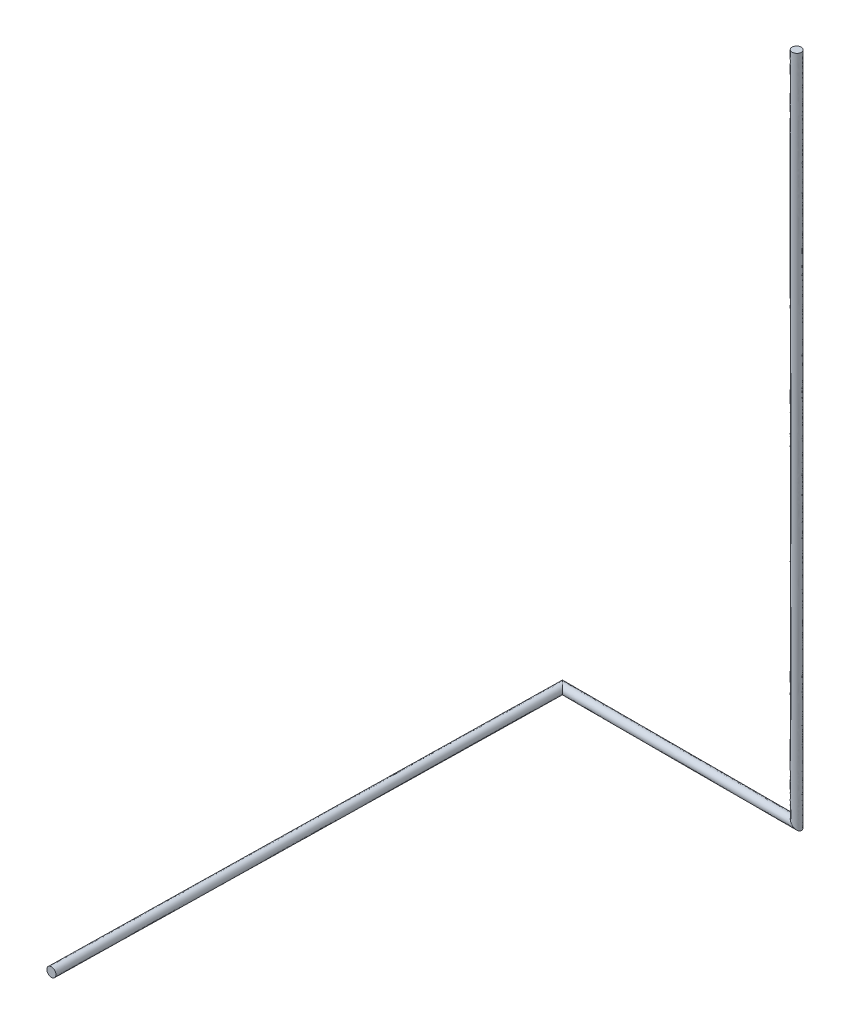
ISO-10303-21;
HEADER;
FILE_DESCRIPTION(('STEP AP214'),'2;1');
FILE_NAME('part.step','',(''),(''),'','','');
FILE_SCHEMA(('AUTOMOTIVE_DESIGN { 1 0 10303 214 1 1 1 1 }'));
ENDSEC;
DATA;
#1=APPLICATION_CONTEXT('core data for automotive mechanical design processes');
#2=APPLICATION_PROTOCOL_DEFINITION('international standard','automotive_design',2000,#1);
#3=PRODUCT_CONTEXT('',#1,'mechanical');
#4=PRODUCT('Part','Part','',(#3));
#5=PRODUCT_RELATED_PRODUCT_CATEGORY('part','',(#4));
#6=PRODUCT_DEFINITION_FORMATION('','',#4);
#7=PRODUCT_DEFINITION_CONTEXT('part definition',#1,'design');
#8=PRODUCT_DEFINITION('design','',#6,#7);
#9=PRODUCT_DEFINITION_SHAPE('','',#8);
#10=(LENGTH_UNIT() NAMED_UNIT(*) SI_UNIT(.MILLI.,.METRE.));
#11=(NAMED_UNIT(*) PLANE_ANGLE_UNIT() SI_UNIT($,.RADIAN.));
#12=(NAMED_UNIT(*) SI_UNIT($,.STERADIAN.) SOLID_ANGLE_UNIT());
#13=UNCERTAINTY_MEASURE_WITH_UNIT(LENGTH_MEASURE(1.E-05),#10,'distance_accuracy_value','');
#14=(GEOMETRIC_REPRESENTATION_CONTEXT(3) GLOBAL_UNCERTAINTY_ASSIGNED_CONTEXT((#13)) GLOBAL_UNIT_ASSIGNED_CONTEXT((#10,
#11,#12)) REPRESENTATION_CONTEXT('',''));
#15=CARTESIAN_POINT('',(0.,0.,0.));
#16=DIRECTION('',(0.,0.,1.));
#17=DIRECTION('',(1.,0.,0.));
#18=AXIS2_PLACEMENT_3D('',#15,#16,#17);
#19=CARTESIAN_POINT('',(726.915828906239,2000.,-1499.75849327626));
#20=DIRECTION('',(0.,-0.999838995517509,0.0179438859374929));
#21=DIRECTION('',(0.,0.0179438859374929,0.999838995517509));
#22=AXIS2_PLACEMENT_3D('',#19,#20,#21);
#23=PLANE('',#22);
#24=CARTESIAN_POINT('',(726.915828906239,2000.,-1499.75849327626));
#25=DIRECTION('',(0.,-0.999838995517509,0.0179438859374929));
#26=DIRECTION('',(0.,0.0179438859374929,0.999838995517509));
#27=AXIS2_PLACEMENT_3D('',#24,#25,#26);
#28=CIRCLE('',#27,13.7);
#29=CARTESIAN_POINT('',(726.915828906239,2000.24583123734,-1486.06069903767));
#30=VERTEX_POINT('',#29);
#31=EDGE_CURVE('E36',#30,#30,#28,.T.);
#32=ORIENTED_EDGE('',*,*,#31,.F.);
#33=EDGE_LOOP('',(#32));
#34=FACE_BOUND('',#33,.T.);
#35=ADVANCED_FACE('F33',(#34),#23,.F.);
#36=CARTESIAN_POINT('',(0.,0.,0.));
#37=DIRECTION('',(0.,0.,1.));
#38=DIRECTION('',(1.,0.,0.));
#39=AXIS2_PLACEMENT_3D('',#36,#37,#38);
#40=PLANE('',#39);
#41=CARTESIAN_POINT('',(0.,0.,0.));
#42=DIRECTION('',(0.,0.,1.));
#43=DIRECTION('',(1.,0.,0.));
#44=AXIS2_PLACEMENT_3D('',#41,#42,#43);
#45=CIRCLE('',#44,13.7);
#46=CARTESIAN_POINT('',(13.7,0.,0.));
#47=VERTEX_POINT('',#46);
#48=EDGE_CURVE('E41',#47,#47,#45,.T.);
#49=ORIENTED_EDGE('',*,*,#48,.T.);
#50=EDGE_LOOP('',(#49));
#51=FACE_BOUND('',#50,.T.);
#52=ADVANCED_FACE('F70',(#51),#40,.T.);
#53=CARTESIAN_POINT('',(726.915828906239,-30.2645831237342,-1486.06069903767));
#54=CARTESIAN_POINT('',(726.915828906239,2000.24583123734,-1486.06069903767));
#55=CARTESIAN_POINT('',(699.515828906239,-30.2645831237342,-1486.06069903767));
#56=CARTESIAN_POINT('',(699.515828906239,2000.24583123734,-1486.06069903767));
#57=CARTESIAN_POINT('',(699.515828906239,-30.7562455984215,-1513.45628751485));
#58=CARTESIAN_POINT('',(699.515828906239,1999.75416876266,-1513.45628751485));
#59=CARTESIAN_POINT('',(726.915828906239,-30.7562455984215,-1513.45628751485));
#60=CARTESIAN_POINT('',(726.915828906239,1999.75416876266,-1513.45628751485));
#61=CARTESIAN_POINT('',(754.315828906239,-30.7562455984215,-1513.45628751485));
#62=CARTESIAN_POINT('',(754.315828906239,1999.75416876266,-1513.45628751485));
#63=CARTESIAN_POINT('',(754.315828906239,-30.2645831237342,-1486.06069903767));
#64=CARTESIAN_POINT('',(754.315828906239,2000.24583123734,-1486.06069903767));
#65=CARTESIAN_POINT('',(726.915828906239,-30.2645831237342,-1486.06069903767));
#66=CARTESIAN_POINT('',(726.915828906239,2000.24583123734,-1486.06069903767));
#67=(BOUNDED_SURFACE() B_SPLINE_SURFACE(3,1,((#53,#54),(#55,#56),(#57,#58),(#59,#60),(#61,#62),
(#63,#64),(#65,#66)),.UNSPECIFIED.,.T.,.F.,.F.) B_SPLINE_SURFACE_WITH_KNOTS((4,3,4),(2,2),(0.,
0.5,1.),(0.,1.),.UNSPECIFIED.) GEOMETRIC_REPRESENTATION_ITEM() RATIONAL_B_SPLINE_SURFACE(((1.,
1.),(0.333333333333333,0.333333333333333),(0.333333333333333,0.333333333333333),(1.,1.),
(0.333333333333333,0.333333333333333),(0.333333333333333,0.333333333333333),(1.,1.))) REPRESENTATION_ITEM('') SURFACE());
#68=CARTESIAN_POINT('',(726.915828906239,0.,-1486.06069903767));
#69=CARTESIAN_POINT('',(727.320432142398,-0.40460323615911,-1486.06070090007));
#70=CARTESIAN_POINT('',(727.724994111372,-0.809165205132837,-1486.07860653226));
#71=CARTESIAN_POINT('',(728.532601324905,-1.61677241866552,-1486.15037918501));
#72=CARTESIAN_POINT('',(728.935646363273,-2.01981745703372,-1486.20425092853));
#73=CARTESIAN_POINT('',(729.742243541552,-2.82641463531296,-1486.34905858627));
#74=CARTESIAN_POINT('',(730.145764996216,-3.229936089977,-1486.44033732122));
#75=CARTESIAN_POINT('',(730.947643484734,-4.03181457849519,-1486.66070282806));
#76=CARTESIAN_POINT('',(731.346000442283,-4.43017153604357,-1486.78979015791));
#77=CARTESIAN_POINT('',(732.135838772546,-5.22000986630708,-1487.08694966971));
#78=CARTESIAN_POINT('',(732.527312741102,-5.61148383486269,-1487.2550613641));
#79=CARTESIAN_POINT('',(733.300473996465,-6.38464509022531,-1487.63150711488));
#80=CARTESIAN_POINT('',(733.682162668596,-6.76633376235683,-1487.83983544171));
#81=CARTESIAN_POINT('',(734.374217860209,-7.45838895396948,-1488.26251049803));
#82=CARTESIAN_POINT('',(734.686420591712,-7.77059168547318,-1488.47084659314));
#83=CARTESIAN_POINT('',(735.299634266218,-8.38380535997887,-1488.91838023845));
#84=CARTESIAN_POINT('',(735.600644927006,-8.68481602076712,-1489.15757856618));
#85=CARTESIAN_POINT('',(736.188530594612,-9.27270168837269,-1489.66763047559));
#86=CARTESIAN_POINT('',(736.475421078288,-9.55959217204867,-1489.9384482495));
#87=CARTESIAN_POINT('',(737.032258099216,-10.1164291929771,-1490.5129382421));
#88=CARTESIAN_POINT('',(737.302209564841,-10.3863806586021,-1490.81660083398));
#89=CARTESIAN_POINT('',(737.757132750147,-10.8413038439077,-1491.37816922031));
#90=CARTESIAN_POINT('',(737.946602353964,-11.0307734477245,-1491.62880205437));
#91=CARTESIAN_POINT('',(738.311945839762,-11.3961169335221,-1492.14922639493));
#92=CARTESIAN_POINT('',(738.487820438068,-11.5719915318285,-1492.41901689057));
#93=CARTESIAN_POINT('',(738.823671737076,-11.9078428308371,-1492.97730549506));
#94=CARTESIAN_POINT('',(738.983664147583,-12.0678352413433,-1493.26578464165));
#95=CARTESIAN_POINT('',(739.285583163198,-12.3697542569587,-1493.86109398305));
#96=CARTESIAN_POINT('',(739.427513286729,-12.51168438049,-1494.16792058673));
#97=CARTESIAN_POINT('',(739.666220705774,-12.7503917995353,-1494.73985695101));
#98=CARTESIAN_POINT('',(739.766481165223,-12.8506522589832,-1495.00206369768));
#99=CARTESIAN_POINT('',(739.95201467224,-13.0361857660003,-1495.53685763621));
#100=CARTESIAN_POINT('',(740.037290818729,-13.12146191249,-1495.8094426675));
#101=CARTESIAN_POINT('',(740.19150948744,-13.2756805812012,-1496.36360101185));
#102=CARTESIAN_POINT('',(740.260458790456,-13.3446298842167,-1496.64517053818));
#103=CARTESIAN_POINT('',(740.380867541018,-13.4650386347782,-1497.21572461611));
#104=CARTESIAN_POINT('',(740.432326797909,-13.51649789167,-1497.50470924849));
#105=CARTESIAN_POINT('',(740.516995043769,-13.6011661375292,-1498.08960679963));
#106=CARTESIAN_POINT('',(740.550105227598,-13.6342763213588,-1498.3855484506));
#107=CARTESIAN_POINT('',(740.596968610694,-13.6811397044552,-1498.98049477772));
#108=CARTESIAN_POINT('',(740.610721787682,-13.6948928814432,-1499.2794994574));
#109=CARTESIAN_POINT('',(740.61857666689,-13.7027477606509,-1499.87797962694));
#110=CARTESIAN_POINT('',(740.612681348782,-13.6968524425426,-1500.17745503853));
#111=CARTESIAN_POINT('',(740.581371335567,-13.6655424293277,-1500.77434293081));
#112=CARTESIAN_POINT('',(740.555957528392,-13.640128622153,-1501.07175550473));
#113=CARTESIAN_POINT('',(740.489089610254,-13.5732607040143,-1501.63721774845));
#114=CARTESIAN_POINT('',(740.449164639588,-13.5333357333483,-1501.90563288513));
#115=CARTESIAN_POINT('',(740.35406975191,-13.4382408456711,-1502.43696829679));
#116=CARTESIAN_POINT('',(740.298901204811,-13.383072298572,-1502.69988906326));
#117=CARTESIAN_POINT('',(740.174161732166,-13.2583328259262,-1503.21884202736));
#118=CARTESIAN_POINT('',(740.104588044843,-13.1887591386036,-1503.4748728934));
#119=CARTESIAN_POINT('',(739.952024934948,-13.0361960287091,-1503.97882820469));
#120=CARTESIAN_POINT('',(739.869032960099,-12.9532040538599,-1504.22675109692));
#121=CARTESIAN_POINT('',(739.662859247246,-12.7470303410064,-1504.78946718192));
#122=CARTESIAN_POINT('',(739.535215307263,-12.6193864010231,-1505.10100349151));
#123=CARTESIAN_POINT('',(739.261060631297,-12.3452317250572,-1505.70698744777));
#124=CARTESIAN_POINT('',(739.114545175841,-12.1987162696017,-1506.00143079295));
#125=CARTESIAN_POINT('',(738.804762043672,-11.8889331374329,-1506.57274663366));
#126=CARTESIAN_POINT('',(738.641471490969,-11.7256425847295,-1506.84959427912));
#127=CARTESIAN_POINT('',(738.300525815084,-11.384696908845,-1507.38481201077));
#128=CARTESIAN_POINT('',(738.122869873838,-11.2070409675984,-1507.64318104307));
#129=CARTESIAN_POINT('',(737.439454506089,-10.5236255998501,-1508.56902069092));
#130=CARTESIAN_POINT('',(736.893366617514,-9.97753771127435,-1509.17844553905));
#131=CARTESIAN_POINT('',(736.029369100144,-9.11354019390492,-1509.99359800997));
#132=CARTESIAN_POINT('',(735.733513506462,-8.81768460022294,-1510.24906280438));
#133=CARTESIAN_POINT('',(735.129159900926,-8.21333099468712,-1510.728496172));
#134=CARTESIAN_POINT('',(734.820661681351,-7.90483277511176,-1510.95246422745));
#135=CARTESIAN_POINT('',(734.078504753421,-7.16267584718238,-1511.44640948721));
#136=CARTESIAN_POINT('',(733.640440266067,-6.7246113598278,-1511.7031331372));
#137=CARTESIAN_POINT('',(732.750229243521,-5.83440033728173,-1512.16216504453));
#138=CARTESIAN_POINT('',(732.298077780656,-5.38224887441668,-1512.36445401645));
#139=CARTESIAN_POINT('',(731.383441752209,-4.46761284596934,-1512.71676009948));
#140=CARTESIAN_POINT('',(730.920950675996,-4.00512176975613,-1512.86674322846));
#141=CARTESIAN_POINT('',(729.989262233893,-3.07343332765369,-1513.1158523103));
#142=CARTESIAN_POINT('',(729.520065558067,-2.60423665182781,-1513.21498345807));
#143=CARTESIAN_POINT('',(728.568049020889,-1.65222011464995,-1513.36501796652));
#144=CARTESIAN_POINT('',(728.085147753142,-1.16931884690275,-1513.41488464281));
#145=CARTESIAN_POINT('',(727.11803790945,-0.202209003210842,-1513.46334795311));
#146=CARTESIAN_POINT('',(726.633829250425,0.281999655814152,-1513.46194124836));
#147=CARTESIAN_POINT('',(725.666890490668,1.24893841557173,-1513.40783768975));
#148=CARTESIAN_POINT('',(725.184160245132,1.73166866110723,-1513.35514603137));
#149=CARTESIAN_POINT('',(724.222959224077,2.69286968216252,-1513.19789111618));
#150=CARTESIAN_POINT('',(723.744487993359,3.17134091288026,-1513.09333347217));
#151=CARTESIAN_POINT('',(722.838427074517,4.07740183172263,-1512.84320943413));
#152=CARTESIAN_POINT('',(722.41019643889,4.50563246734914,-1512.70228516774));
#153=CARTESIAN_POINT('',(721.562335332103,5.35349357413633,-1512.37535863816));
#154=CARTESIAN_POINT('',(721.142705475903,5.77312343033621,-1512.18935316376));
#155=CARTESIAN_POINT('',(720.315637534704,6.60019137153509,-1511.77080511893));
#156=CARTESIAN_POINT('',(719.908187687375,7.00764121886417,-1511.53830923106));
#157=CARTESIAN_POINT('',(719.108937649654,7.80689125658502,-1511.02468698351));
#158=CARTESIAN_POINT('',(718.717131634559,8.19869727168042,-1510.7435789355));
#159=CARTESIAN_POINT('',(718.06696876921,8.84886013702915,-1510.22133643863));
#160=CARTESIAN_POINT('',(717.803447462296,9.11238144394346,-1509.99300966118));
#161=CARTESIAN_POINT('',(717.288531845091,9.62729706114841,-1509.5103670134));
#162=CARTESIAN_POINT('',(717.037136952681,9.87869195355863,-1509.25605239242));
#163=CARTESIAN_POINT('',(716.549212999916,10.3666159063227,-1508.7211007314));
#164=CARTESIAN_POINT('',(716.312665918822,10.6031629874171,-1508.44049667234));
#165=CARTESIAN_POINT('',(715.85690702506,11.0589218811795,-1507.8521697882));
#166=CARTESIAN_POINT('',(715.637697130085,11.278131776154,-1507.54444397109));
#167=CARTESIAN_POINT('',(715.26749260527,11.6483363009698,-1506.97494692355));
#168=CARTESIAN_POINT('',(715.112311647448,11.8035172587909,-1506.71860939909));
#169=CARTESIAN_POINT('',(714.816163558537,12.0996653477024,-1506.19016935131));
#170=CARTESIAN_POINT('',(714.675188411041,12.240640495198,-1505.91807585723));
#171=CARTESIAN_POINT('',(714.409338987581,12.5064899186582,-1505.35879986739));
#172=CARTESIAN_POINT('',(714.284454208118,12.6313746981214,-1505.07162738904));
#173=CARTESIAN_POINT('',(714.052666446751,12.8631624594882,-1504.48309411337));
#174=CARTESIAN_POINT('',(713.945760753428,12.9700681528119,-1504.18173546425));
#175=CARTESIAN_POINT('',(713.766768212384,13.1490606938556,-1503.61362493598));
#176=CARTESIAN_POINT('',(713.691855986698,13.2239729195412,-1503.34865082509));
#177=CARTESIAN_POINT('',(713.557457473388,13.3583714328508,-1502.81098254455));
#178=CARTESIAN_POINT('',(713.497969661931,13.4178592443081,-1502.53828914048));
#179=CARTESIAN_POINT('',(713.39542767383,13.5204012324093,-1501.98689508318));
#180=CARTESIAN_POINT('',(713.352366560477,13.5634623457628,-1501.70819701826));
#181=CARTESIAN_POINT('',(713.283415276542,13.6324136296974,-1501.14656448804));
#182=CARTESIAN_POINT('',(713.25752532089,13.6583035853486,-1500.86362996975));
#183=CARTESIAN_POINT('',(713.223363257445,13.6924656487943,-1500.29486655286));
#184=CARTESIAN_POINT('',(713.215138703307,13.7006902029327,-1500.00903191771));
#185=CARTESIAN_POINT('',(713.216609835416,13.6992190708236,-1499.43745506681));
#186=CARTESIAN_POINT('',(713.226305533829,13.6895233724103,-1499.15171285111));
#187=CARTESIAN_POINT('',(713.263429364519,13.6523995417201,-1498.58251525019));
#188=CARTESIAN_POINT('',(713.290859715903,13.6249691903366,-1498.29906015563));
#189=CARTESIAN_POINT('',(713.362933970214,13.5528949360247,-1497.73657638536));
#190=CARTESIAN_POINT('',(713.407577826576,13.508251079663,-1497.45754769766));
#191=CARTESIAN_POINT('',(713.511271931069,13.4045569751708,-1496.91625361628));
#192=CARTESIAN_POINT('',(713.569712800073,13.3461161061664,-1496.65375350888));
#193=CARTESIAN_POINT('',(713.700880325989,13.2149485802501,-1496.13602956807));
#194=CARTESIAN_POINT('',(713.773606207099,13.1422226991401,-1495.88080534038));
#195=CARTESIAN_POINT('',(713.932345143332,12.983483762907,-1495.37873001846));
#196=CARTESIAN_POINT('',(714.018360428471,12.8974684777681,-1495.13188033799));
#197=CARTESIAN_POINT('',(714.202605001964,12.7132239042753,-1494.64745275748));
#198=CARTESIAN_POINT('',(714.300836789183,12.6149921170566,-1494.40987676744));
#199=CARTESIAN_POINT('',(714.5504966152,12.3653322910389,-1493.85041393849));
#200=CARTESIAN_POINT('',(714.707356018383,12.208472887856,-1493.53335226681));
#201=CARTESIAN_POINT('',(715.040173703206,11.8756552030333,-1492.91995153919));
#202=CARTESIAN_POINT('',(715.21613818546,11.6996907207793,-1492.62361926267));
#203=CARTESIAN_POINT('',(715.584827962313,11.3310009439267,-1492.05165937798));
#204=CARTESIAN_POINT('',(715.777583750302,11.1382451559376,-1491.77607120691));
#205=CARTESIAN_POINT('',(716.177182229481,10.7386466767587,-1491.24625038021));
#206=CARTESIAN_POINT('',(716.38402523848,10.5318036677595,-1490.99201820666));
#207=CARTESIAN_POINT('',(716.890088606272,10.0257402999666,-1490.41263453885));
#208=CARTESIAN_POINT('',(717.194720533544,9.72110837269575,-1490.0969111818));
#209=CARTESIAN_POINT('',(717.822305493455,9.09352341278456,-1489.50420537301));
#210=CARTESIAN_POINT('',(718.145266110488,8.77056279575111,-1489.22723912565));
#211=CARTESIAN_POINT('',(718.805841893216,8.10998701302308,-1488.71065902666));
#212=CARTESIAN_POINT('',(719.143460590897,7.77236831534194,-1488.47105424215));
#213=CARTESIAN_POINT('',(719.830161078552,7.08566782768728,-1488.02793692925));
#214=CARTESIAN_POINT('',(720.179240164446,6.73658874179358,-1487.82441595838));
#215=CARTESIAN_POINT('',(721.033548951048,5.88227995519181,-1487.37464875621));
#216=CARTESIAN_POINT('',(721.543385882179,5.37244302406049,-1487.14579387538));
#217=CARTESIAN_POINT('',(722.574997177482,4.34083172875678,-1486.75477332943));
#218=CARTESIAN_POINT('',(723.096759624575,3.81906928166423,-1486.59254391883));
#219=CARTESIAN_POINT('',(724.165854691859,2.74997421437974,-1486.32782330312));
#220=CARTESIAN_POINT('',(724.713457418212,2.20237148802758,-1486.22752247249));
#221=CARTESIAN_POINT('',(725.812675591776,1.10315331446378,-1486.09396276191));
#222=CARTESIAN_POINT('',(726.364290590369,0.551538315870761,-1486.06069649894));
#223=CARTESIAN_POINT('',(726.915828906239,0.,-1486.06069903767));
#224=B_SPLINE_CURVE_WITH_KNOTS('',3,(#68,#69,#70,#71,#72,#73,#74,#75,#76,#77,#78,#79,#80,#81,
#82,#83,#84,#85,#86,#87,#88,#89,#90,#91,#92,#93,#94,#95,#96,#97,#98,#99,#100,#101,#102,#103,
#104,#105,#106,#107,#108,#109,#110,#111,#112,#113,#114,#115,#116,#117,#118,#119,#120,#121,#122,
#123,#124,#125,#126,#127,#128,#129,#130,#131,#132,#133,#134,#135,#136,#137,#138,#139,#140,#141,
#142,#143,#144,#145,#146,#147,#148,#149,#150,#151,#152,#153,#154,#155,#156,#157,#158,#159,#160,
#161,#162,#163,#164,#165,#166,#167,#168,#169,#170,#171,#172,#173,#174,#175,#176,#177,#178,#179,
#180,#181,#182,#183,#184,#185,#186,#187,#188,#189,#190,#191,#192,#193,#194,#195,#196,#197,#198,
#199,#200,#201,#202,#203,#204,#205,#206,#207,#208,#209,#210,#211,#212,#213,#214,#215,#216,#217,
#218,#219,#220,#221,#222,#223),.UNSPECIFIED.,.T.,.F.,(4,2,2,2,2,2,2,2,2,2,2,2,2,2,2,2,2,2,2,2,2,
2,2,2,2,2,2,2,2,2,2,2,2,2,2,2,2,2,2,2,2,2,2,2,2,2,2,2,2,2,2,2,2,2,2,2,2,2,2,2,2,2,2,2,2,2,2,2,2,
2,2,2,2,2,2,2,2,4),(0.,1.71620265252712,3.43263071682636,5.16515405374644,6.89770295970259,
8.63201379430195,10.3660777277032,11.8295816537682,13.2931224578349,14.7550216483596,
16.2164935110496,17.3162995101258,18.4160475204875,19.5146966472061,20.6131314352053,
21.5065408178843,22.3997652156598,23.2926179901213,24.1854804970122,25.0831052529056,
25.9807310419183,26.878220713195,27.7756695584325,28.597625121153,29.4195068402472,
30.2415462779304,31.0637422591541,32.1423379997145,33.2212040059588,34.3015612857566,
35.3819801320228,38.3147136766916,39.7845821473933,41.254474778093,43.2634811079769,
45.2731982650732,47.2842186757256,49.2950336044724,51.3473145506273,53.3997291349945,
55.4519358190408,57.5039204668044,59.3676559074462,61.2315241446472,63.0935301243831,
64.954836228184,66.2650442183816,67.5751892502911,68.8837121258793,70.1923795374172,
71.2038595285213,72.2147655021674,73.2250081948773,74.2350983963276,75.0903279691013,
75.94547301845,76.8002565540773,77.6550507887574,78.512143182923,79.3692361589543,
80.2264364023256,81.0836343267879,81.9083805913027,82.7330820772144,83.557922101979,
84.382931124741,85.542089090983,86.7016243966165,87.863311186016,89.0250241918838,
90.6250006138264,92.2256440013843,93.8266752414182,95.4273313952097,97.6931587539393,
99.9568131501589,102.296526983599,104.635983112653),.UNSPECIFIED.);
#225=CARTESIAN_POINT('',(726.915828906239,0.,-1486.06069903767));
#226=VERTEX_POINT('',#225);
#227=EDGE_CURVE('E51',#226,#226,#224,.T.);
#228=ORIENTED_EDGE('',*,*,#227,.T.);
#229=EDGE_LOOP('',(#228));
#230=FACE_BOUND('',#229,.T.);
#231=ORIENTED_EDGE('',*,*,#31,.T.);
#232=EDGE_LOOP('',(#231));
#233=FACE_BOUND('',#232,.T.);
#234=ADVANCED_FACE('F62',(#230,#233),#67,.F.);
#235=CARTESIAN_POINT('',(12.5324888657394,0.,-1486.06069903767));
#236=CARTESIAN_POINT('',(757.672074504661,0.,-1486.06069903767));
#237=CARTESIAN_POINT('',(12.5324888657394,27.4,-1486.06069903767));
#238=CARTESIAN_POINT('',(757.672074504661,27.4,-1486.06069903767));
#239=CARTESIAN_POINT('',(12.040826391052,27.4,-1513.45628751485));
#240=CARTESIAN_POINT('',(757.180412029974,27.4,-1513.45628751485));
#241=CARTESIAN_POINT('',(12.040826391052,0.,-1513.45628751485));
#242=CARTESIAN_POINT('',(757.180412029974,0.,-1513.45628751485));
#243=CARTESIAN_POINT('',(12.040826391052,-27.4,-1513.45628751485));
#244=CARTESIAN_POINT('',(757.180412029974,-27.4,-1513.45628751485));
#245=CARTESIAN_POINT('',(12.5324888657394,-27.4,-1486.06069903767));
#246=CARTESIAN_POINT('',(757.672074504661,-27.4,-1486.06069903767));
#247=CARTESIAN_POINT('',(12.5324888657394,0.,-1486.06069903767));
#248=CARTESIAN_POINT('',(757.672074504661,0.,-1486.06069903767));
#249=(BOUNDED_SURFACE() B_SPLINE_SURFACE(3,1,((#235,#236),(#237,#238),(#239,#240),(#241,#242),
(#243,#244),(#245,#246),(#247,#248)),.UNSPECIFIED.,.T.,.F.,.F.) B_SPLINE_SURFACE_WITH_KNOTS((4,
3,4),(2,2),(0.,0.5,1.),(0.,1.),
.UNSPECIFIED.) GEOMETRIC_REPRESENTATION_ITEM() RATIONAL_B_SPLINE_SURFACE(((1.,1.),
(0.333333333333333,0.333333333333333),(0.333333333333333,0.333333333333333),(1.,1.),
(0.333333333333333,0.333333333333333),(0.333333333333333,0.333333333333333),(1.,1.))) REPRESENTATION_ITEM('') SURFACE());
#250=CARTESIAN_POINT('',(40.3699976688957,0.,-1486.06069903767));
#251=CARTESIAN_POINT('',(40.3699944726499,-0.306831205440463,-1486.0607022918));
#252=CARTESIAN_POINT('',(40.3598524808687,-0.613734215309912,-1486.0710279328));
#253=CARTESIAN_POINT('',(40.3194870543471,-1.22497659542816,-1486.11212428862));
#254=CARTESIAN_POINT('',(40.2892514327074,-1.52931429629398,-1486.14290741103));
#255=CARTESIAN_POINT('',(40.2092464220731,-2.13338965335241,-1486.22436113687));
#256=CARTESIAN_POINT('',(40.1594346539438,-2.43311585367923,-1486.27507488682));
#257=CARTESIAN_POINT('',(40.041287078606,-3.02496287164463,-1486.39536185552));
#258=CARTESIAN_POINT('',(39.9729536540313,-3.31708466222362,-1486.46493264848));
#259=CARTESIAN_POINT('',(39.8195721333411,-3.88980274896263,-1486.62109157197));
#260=CARTESIAN_POINT('',(39.7346479237137,-4.17046688444708,-1486.70755357269));
#261=CARTESIAN_POINT('',(39.5491566564694,-4.72102545637778,-1486.89640367979));
#262=CARTESIAN_POINT('',(39.4485894719207,-4.99091980541235,-1486.9987919154));
#263=CARTESIAN_POINT('',(39.2332700767919,-5.51881394937377,-1487.21801027233));
#264=CARTESIAN_POINT('',(39.118520978938,-5.77681633740747,-1487.33483722457));
#265=CARTESIAN_POINT('',(38.8762250077917,-6.28030373317221,-1487.58152064412));
#266=CARTESIAN_POINT('',(38.7486751952625,-6.52578584645438,-1487.71138010389));
#267=CARTESIAN_POINT('',(38.4287201790637,-7.09954418231774,-1488.03712880341));
#268=CARTESIAN_POINT('',(38.2308051439581,-7.42158657203333,-1488.23862764555));
#269=CARTESIAN_POINT('',(37.8159478623929,-8.03966118715328,-1488.66099708222));
#270=CARTESIAN_POINT('',(37.5989992465496,-8.33568463875005,-1488.88187416148));
#271=CARTESIAN_POINT('',(37.1486902234091,-8.90225311674729,-1489.34033729299));
#272=CARTESIAN_POINT('',(36.9153008154251,-9.17275104704897,-1489.57795287107));
#273=CARTESIAN_POINT('',(36.435062617457,-9.68807074401739,-1490.06688712909));
#274=CARTESIAN_POINT('',(36.1882135126632,-9.93289190973652,-1490.31820612955));
#275=CARTESIAN_POINT('',(35.5886185057857,-10.4845514398077,-1490.9286584864));
#276=CARTESIAN_POINT('',(35.230836747094,-10.7802761805415,-1491.29291888772));
#277=CARTESIAN_POINT('',(34.4986143796373,-11.3262791752109,-1492.03840019565));
#278=CARTESIAN_POINT('',(34.1241676512047,-11.5765405598865,-1492.41962733275));
#279=CARTESIAN_POINT('',(33.3622746119829,-12.0334353375718,-1493.19531658321));
#280=CARTESIAN_POINT('',(32.9748223338903,-12.2400483774485,-1493.58978477193));
#281=CARTESIAN_POINT('',(32.1902124975139,-12.6110650111081,-1494.3886021709));
#282=CARTESIAN_POINT('',(31.7930558531973,-12.7754725631937,-1494.79295045063));
#283=CARTESIAN_POINT('',(30.9808031681227,-13.0672894618577,-1495.61991124963));
#284=CARTESIAN_POINT('',(30.5655117342755,-13.1935874159227,-1496.04272270014));
#285=CARTESIAN_POINT('',(29.7297524095118,-13.4041779632995,-1496.8936157925));
#286=CARTESIAN_POINT('',(29.3092844289436,-13.4884698280635,-1497.32169752563));
#287=CARTESIAN_POINT('',(28.4650904633001,-13.6158051635943,-1498.18117799171));
#288=CARTESIAN_POINT('',(28.041362968392,-13.65882819363,-1498.61257826183));
#289=CARTESIAN_POINT('',(27.1928295476391,-13.7039266899136,-1499.47647676103));
#290=CARTESIAN_POINT('',(26.7680235444192,-13.7059991301768,-1499.90897506888));
#291=CARTESIAN_POINT('',(25.826547459871,-13.6651922081974,-1500.86749921959));
#292=CARTESIAN_POINT('',(25.3100724027111,-13.6123987208125,-1501.39332650681));
#293=CARTESIAN_POINT('',(24.2818733030447,-13.4453536775825,-1502.44014403616));
#294=CARTESIAN_POINT('',(23.7701505577883,-13.3310858150736,-1502.96113295754));
#295=CARTESIAN_POINT('',(22.7558145226585,-13.0397047107034,-1503.99383639267));
#296=CARTESIAN_POINT('',(22.253196334962,-12.8626263810039,-1504.50555589293));
#297=CARTESIAN_POINT('',(21.2615487787504,-12.4434229853874,-1505.51516001057));
#298=CARTESIAN_POINT('',(20.7725128675098,-12.2013298592044,-1506.01305128915));
#299=CARTESIAN_POINT('',(19.9695859151252,-11.7389767197923,-1506.8305174869));
#300=CARTESIAN_POINT('',(19.6504317733762,-11.5371963648614,-1507.15545080989));
#301=CARTESIAN_POINT('',(19.0229966345485,-11.1015911306035,-1507.7942474224));
#302=CARTESIAN_POINT('',(18.7147149716618,-10.8677682177955,-1508.10811138979));
#303=CARTESIAN_POINT('',(18.1120195377133,-10.367317192852,-1508.72172031565));
#304=CARTESIAN_POINT('',(17.8175878843052,-10.1007330826371,-1509.02148348027));
#305=CARTESIAN_POINT('',(17.2452975007467,-9.5334847748506,-1509.60413678699));
#306=CARTESIAN_POINT('',(16.9674344019089,-9.23282962209319,-1509.88703137688));
#307=CARTESIAN_POINT('',(16.4976105945948,-8.67456868275236,-1510.36536266248));
#308=CARTESIAN_POINT('',(16.3012747070014,-8.42444638109272,-1510.56525376221));
#309=CARTESIAN_POINT('',(15.9220783375607,-7.90413073074287,-1510.95131654589));
#310=CARTESIAN_POINT('',(15.7392171020578,-7.63393850629053,-1511.13748899715));
#311=CARTESIAN_POINT('',(15.3892940894047,-7.07385975071099,-1511.49374834778));
#312=CARTESIAN_POINT('',(15.2222176428176,-6.78399194420795,-1511.66385018222));
#313=CARTESIAN_POINT('',(14.9060823283791,-6.18486737883826,-1511.98571001356));
#314=CARTESIAN_POINT('',(14.7570198902906,-5.87561448045945,-1512.13747164534));
#315=CARTESIAN_POINT('',(14.5059594574914,-5.29956021475067,-1512.39307823171));
#316=CARTESIAN_POINT('',(14.4004070113363,-5.03590870473228,-1512.50054200107));
#317=CARTESIAN_POINT('',(14.2042024461823,-4.49756559589622,-1512.7002994004));
#318=CARTESIAN_POINT('',(14.1135471982685,-4.22287633050267,-1512.79259621594));
#319=CARTESIAN_POINT('',(13.9485347808021,-3.66380698911005,-1512.96059664623));
#320=CARTESIAN_POINT('',(13.8741707858923,-3.37943102935546,-1513.03630720992));
#321=CARTESIAN_POINT('',(13.7429640668846,-2.80252809028047,-1513.16988979472));
#322=CARTESIAN_POINT('',(13.6861215365494,-2.51000102085922,-1513.22776161856));
#323=CARTESIAN_POINT('',(13.5907581216189,-1.91712654410918,-1513.3248518557));
#324=CARTESIAN_POINT('',(13.5523446316191,-1.6167438026051,-1513.36396092971));
#325=CARTESIAN_POINT('',(13.4951167780562,-1.01218291618862,-1513.42222505414));
#326=CARTESIAN_POINT('',(13.4763024648531,-0.708004761525988,-1513.44138005327));
#327=CARTESIAN_POINT('',(13.4586775682823,-0.0985235573264303,-1513.45932409805));
#328=CARTESIAN_POINT('',(13.4598633089741,0.206779275185689,-1513.4581168862));
#329=CARTESIAN_POINT('',(13.4822054607718,0.815876622276005,-1513.43537016705));
#330=CARTESIAN_POINT('',(13.5033606612049,1.11967122716994,-1513.41383189236));
#331=CARTESIAN_POINT('',(13.5623524959309,1.6955455133218,-1513.35377184494));
#332=CARTESIAN_POINT('',(13.5984865951404,1.96798474885029,-1513.31698343648));
#333=CARTESIAN_POINT('',(13.686244927783,2.50770279330437,-1513.22763599298));
#334=CARTESIAN_POINT('',(13.7378680054701,2.77498198567531,-1513.17507813463));
#335=CARTESIAN_POINT('',(13.8557961475317,3.30285658325159,-1513.05501457266));
#336=CARTESIAN_POINT('',(13.9221021725703,3.56345154988135,-1512.987507891));
#337=CARTESIAN_POINT('',(14.0684390109407,4.0766624931376,-1512.83852121357));
#338=CARTESIAN_POINT('',(14.1484706699095,4.32927797701155,-1512.75704035686));
#339=CARTESIAN_POINT('',(14.3265129287754,4.84070734266487,-1512.57577414333));
#340=CARTESIAN_POINT('',(14.4253247711235,5.09895233721502,-1512.47517303533));
#341=CARTESIAN_POINT('',(14.6359487706036,5.60437187037921,-1512.26073509735));
#342=CARTESIAN_POINT('',(14.7477610442605,5.85154630973863,-1512.14689814875));
#343=CARTESIAN_POINT('',(14.9831640953476,6.33429145786795,-1511.90723246492));
#344=CARTESIAN_POINT('',(15.1067587631059,6.56985829480781,-1511.78139976891));
#345=CARTESIAN_POINT('',(15.364502267598,7.02894996404831,-1511.51898909508));
#346=CARTESIAN_POINT('',(15.4986533891898,7.25247217165193,-1511.38240879102));
#347=CARTESIAN_POINT('',(15.8532321992299,7.80756749803849,-1511.02140933673));
#348=CARTESIAN_POINT('',(16.0803329143319,8.13050787623906,-1510.79019632597));
#349=CARTESIAN_POINT('',(16.5535089216365,8.74675053371737,-1510.30845213939));
#350=CARTESIAN_POINT('',(16.7995922311248,9.04004016785174,-1510.0579128011));
#351=CARTESIAN_POINT('',(17.3080046772388,9.59795075921099,-1509.54029412112));
#352=CARTESIAN_POINT('',(17.5703668571826,9.86251019461343,-1509.27318113776));
#353=CARTESIAN_POINT('',(18.1081119111885,10.3629589483812,-1508.72569870071));
#354=CARTESIAN_POINT('',(18.3834947463441,10.5988483524066,-1508.44532928664));
#355=CARTESIAN_POINT('',(19.0481599900562,11.1243890837017,-1507.76862841374));
#356=CARTESIAN_POINT('',(19.4421394953748,11.4019817314623,-1507.36751480402));
#357=CARTESIAN_POINT('',(20.2454879591845,11.9074360348127,-1506.54961946219));
#358=CARTESIAN_POINT('',(20.6548624733983,12.1352795311664,-1506.13283207375));
#359=CARTESIAN_POINT('',(21.4851831253019,12.5431583718796,-1505.28747613669));
#360=CARTESIAN_POINT('',(21.9061315211466,12.7231843125615,-1504.85890528901));
#361=CARTESIAN_POINT('',(22.7563213630378,13.0369640167602,-1503.99332037452));
#362=CARTESIAN_POINT('',(23.1855620243421,13.1707221364224,-1503.55630710666));
#363=CARTESIAN_POINT('',(24.0598106782327,13.3958217106186,-1502.66622772787));
#364=CARTESIAN_POINT('',(24.5049527408906,13.4860990647521,-1502.21302511916));
#365=CARTESIAN_POINT('',(25.3986393569685,13.6203815830744,-1501.30315579934));
#366=CARTESIAN_POINT('',(25.8471839822729,13.6643857669126,-1500.84648901505));
#367=CARTESIAN_POINT('',(26.745793288071,13.7065676089086,-1499.9316078664));
#368=CARTESIAN_POINT('',(27.1958590590046,13.7046979694004,-1499.47339239186));
#369=CARTESIAN_POINT('',(28.0947580200225,13.6549976083045,-1498.55821634297));
#370=CARTESIAN_POINT('',(28.543591138024,13.6071642539331,-1498.101255842));
#371=CARTESIAN_POINT('',(29.5136533654625,13.4529926210761,-1497.11362791608));
#372=CARTESIAN_POINT('',(30.0342293533058,13.3380966019779,-1496.58362543932));
#373=CARTESIAN_POINT('',(31.0664737941954,13.0431925309758,-1495.53268931649));
#374=CARTESIAN_POINT('',(31.5781393320388,12.8631635741597,-1495.01175863843));
#375=CARTESIAN_POINT('',(32.5866400929792,12.4360276599324,-1493.9849961415));
#376=CARTESIAN_POINT('',(33.0834996806369,12.1890385286545,-1493.47913951689));
#377=CARTESIAN_POINT('',(34.0571053607085,11.6248210479214,-1492.48790397418));
#378=CARTESIAN_POINT('',(34.5338664309103,11.3076461445725,-1492.00250980708));
#379=CARTESIAN_POINT('',(35.269142943884,10.7451981826678,-1491.25391904976));
#380=CARTESIAN_POINT('',(35.5367804480468,10.5239965526771,-1490.98143521763));
#381=CARTESIAN_POINT('',(36.0604956602813,10.0552084199024,-1490.44823667201));
#382=CARTESIAN_POINT('',(36.316574683279,9.80762492921917,-1490.18752061977));
#383=CARTESIAN_POINT('',(36.8145329943916,9.2857134343198,-1489.68054537624));
#384=CARTESIAN_POINT('',(37.0564295198017,9.01141902112391,-1489.43426863551));
#385=CARTESIAN_POINT('',(37.5235752940816,8.43537488369052,-1488.95866387624));
#386=CARTESIAN_POINT('',(37.7488300074802,8.13363424500017,-1488.72933029422));
#387=CARTESIAN_POINT('',(38.1338439227546,7.56948012815024,-1488.33734462172));
#388=CARTESIAN_POINT('',(38.2973650793097,7.3122884966117,-1488.17086245581));
#389=CARTESIAN_POINT('',(38.6103237964054,6.78095375381726,-1487.85223674302));
#390=CARTESIAN_POINT('',(38.7597620831179,6.50681151781407,-1487.70009245682));
#391=CARTESIAN_POINT('',(39.0425397802074,5.94223644940603,-1487.4121942761));
#392=CARTESIAN_POINT('',(39.1758860632125,5.65181064961501,-1487.27643338449));
#393=CARTESIAN_POINT('',(39.4244649471326,5.05557057456622,-1487.0233532824));
#394=CARTESIAN_POINT('',(39.5397012268092,4.74975944130153,-1486.90603032654));
#395=CARTESIAN_POINT('',(39.7324754294289,4.17633982407857,-1486.70976540608));
#396=CARTESIAN_POINT('',(39.8130956279338,3.91083789774072,-1486.62768535268));
#397=CARTESIAN_POINT('',(39.9591259852597,3.37146252367638,-1486.47901070599));
#398=CARTESIAN_POINT('',(40.024538976112,3.09759064544839,-1486.4124132294));
#399=CARTESIAN_POINT('',(40.1389914132302,2.54359031656195,-1486.29588830977));
#400=CARTESIAN_POINT('',(40.1880656267834,2.26347652187181,-1486.24592546988));
#401=CARTESIAN_POINT('',(40.2691566285192,1.69836573411118,-1486.16336608803));
#402=CARTESIAN_POINT('',(40.3011820616041,1.41337129168187,-1486.13076074462));
#403=CARTESIAN_POINT('',(40.3395585114373,0.939975150966176,-1486.09168938149));
#404=CARTESIAN_POINT('',(40.350962698412,0.752380423149899,-1486.08007868971));
#405=CARTESIAN_POINT('',(40.366183946763,0.376532884795528,-1486.06458181795));
#406=CARTESIAN_POINT('',(40.3699996301989,0.188279960956236,-1486.06069704086));
#407=CARTESIAN_POINT('',(40.3699976688957,0.,-1486.06069903767));
#408=B_SPLINE_CURVE_WITH_KNOTS('',3,(#250,#251,#252,#253,#254,#255,#256,#257,#258,#259,#260,
#261,#262,#263,#264,#265,#266,#267,#268,#269,#270,#271,#272,#273,#274,#275,#276,#277,#278,#279,
#280,#281,#282,#283,#284,#285,#286,#287,#288,#289,#290,#291,#292,#293,#294,#295,#296,#297,#298,
#299,#300,#301,#302,#303,#304,#305,#306,#307,#308,#309,#310,#311,#312,#313,#314,#315,#316,#317,
#318,#319,#320,#321,#322,#323,#324,#325,#326,#327,#328,#329,#330,#331,#332,#333,#334,#335,#336,
#337,#338,#339,#340,#341,#342,#343,#344,#345,#346,#347,#348,#349,#350,#351,#352,#353,#354,#355,
#356,#357,#358,#359,#360,#361,#362,#363,#364,#365,#366,#367,#368,#369,#370,#371,#372,#373,#374,
#375,#376,#377,#378,#379,#380,#381,#382,#383,#384,#385,#386,#387,#388,#389,#390,#391,#392,#393,
#394,#395,#396,#397,#398,#399,#400,#401,#402,#403,#404,#405,#406,#407),.UNSPECIFIED.,.T.,.F.,(4,
2,2,2,2,2,2,2,2,2,2,2,2,2,2,2,2,2,2,2,2,2,2,2,2,2,2,2,2,2,2,2,2,2,2,2,2,2,2,2,2,2,2,2,2,2,2,2,2,
2,2,2,2,2,2,2,2,2,2,2,2,2,2,2,2,2,2,2,2,2,2,2,2,2,2,2,2,2,4),(0.,0.920280539953635,
1.84111974523606,2.76396349500657,3.68668858606327,4.60277013737266,5.51885912243512,
6.43474739502432,7.3508464526067,8.63398381622452,9.91755221786383,11.2034443785249,
12.4893666279241,14.2568967972696,16.0250814782183,17.794088848969,19.5629302501435,
21.3792444148259,23.1955900803209,25.0128349301933,26.8302140622459,29.0444215701533,
31.2592167075101,33.4727827116877,35.6852632432142,37.1786168608942,38.6718788693434,
40.1631567425434,41.6540396506508,42.7798886357572,43.9056746027359,45.0304038224852,
46.1549097627613,47.0649884798427,47.9748758046633,48.8843811924289,49.7938966376891,
50.7086497424616,51.6234051976796,52.5379925258428,53.4525244095899,54.2834181317674,
55.1142498702988,55.9451359838958,56.776073306828,57.657933612632,58.5398018232958,
59.4219622256978,60.3043140924584,61.6747953661542,63.0458586646446,64.4198023054334,
65.7937418410678,67.6721196535677,69.5511819620552,71.4306135289711,73.3098680979899,
75.2330319657412,77.1562365771266,79.0814241692511,81.0067220419407,83.2590602249693,
85.5121219553337,87.7612445448404,90.0086602970205,91.3318458120774,92.6548804163908,
93.9762721782248,95.2972280995798,96.3381745613957,97.379067318248,98.4195139418607,
99.4597489411924,100.326956172404,101.194001774406,102.059190419009,102.923939934677,
103.488546554696,104.053255688119),.UNSPECIFIED.);
#409=CARTESIAN_POINT('',(40.3699976688958,0.,-1486.06069903767));
#410=VERTEX_POINT('',#409);
#411=EDGE_CURVE('E11',#410,#410,#408,.T.);
#412=ORIENTED_EDGE('',*,*,#411,.T.);
#413=EDGE_LOOP('',(#412));
#414=FACE_BOUND('',#413,.T.);
#415=ORIENTED_EDGE('',*,*,#227,.F.);
#416=EDGE_LOOP('',(#415));
#417=FACE_BOUND('',#416,.T.);
#418=ADVANCED_FACE('F60',(#414,#417),#249,.F.);
#419=CARTESIAN_POINT('',(13.7,0.,0.));
#420=CARTESIAN_POINT('',(40.8880376559111,0.,-1514.92605083826));
#421=CARTESIAN_POINT('',(13.7,27.4,0.));
#422=CARTESIAN_POINT('',(40.8880376559111,27.4,-1514.92605083826));
#423=CARTESIAN_POINT('',(-13.7,27.4,0.));
#424=CARTESIAN_POINT('',(13.4880376559111,27.4,-1514.92605083826));
#425=CARTESIAN_POINT('',(-13.7,0.,0.));
#426=CARTESIAN_POINT('',(13.4880376559111,0.,-1514.92605083826));
#427=CARTESIAN_POINT('',(-13.7,-27.4,0.));
#428=CARTESIAN_POINT('',(13.4880376559111,-27.4,-1514.92605083826));
#429=CARTESIAN_POINT('',(13.7,-27.4,0.));
#430=CARTESIAN_POINT('',(40.8880376559111,-27.4,-1514.92605083826));
#431=CARTESIAN_POINT('',(13.7,0.,0.));
#432=CARTESIAN_POINT('',(40.8880376559111,0.,-1514.92605083826));
#433=(BOUNDED_SURFACE() B_SPLINE_SURFACE(3,1,((#419,#420),(#421,#422),(#423,#424),(#425,#426),
(#427,#428),(#429,#430),(#431,#432)),.UNSPECIFIED.,.T.,.F.,.F.) B_SPLINE_SURFACE_WITH_KNOTS((4,
3,4),(2,2),(0.,0.5,1.),(0.,1.),
.UNSPECIFIED.) GEOMETRIC_REPRESENTATION_ITEM() RATIONAL_B_SPLINE_SURFACE(((1.,1.),
(0.333333333333333,0.333333333333333),(0.333333333333333,0.333333333333333),(1.,1.),
(0.333333333333333,0.333333333333333),(0.333333333333333,0.333333333333333),(1.,1.))) REPRESENTATION_ITEM('') SURFACE());
#434=ORIENTED_EDGE('',*,*,#48,.F.);
#435=EDGE_LOOP('',(#434));
#436=FACE_BOUND('',#435,.T.);
#437=ORIENTED_EDGE('',*,*,#411,.F.);
#438=EDGE_LOOP('',(#437));
#439=FACE_BOUND('',#438,.T.);
#440=ADVANCED_FACE('F58',(#436,#439),#433,.F.);
#441=CLOSED_SHELL('',(#35,#52,#234,#418,#440));
#442=MANIFOLD_SOLID_BREP('B2',#441);
#443=ADVANCED_BREP_SHAPE_REPRESENTATION('',(#18,#442),#14);
#444=SHAPE_DEFINITION_REPRESENTATION(#9,#443);
ENDSEC;
END-ISO-10303-21;
